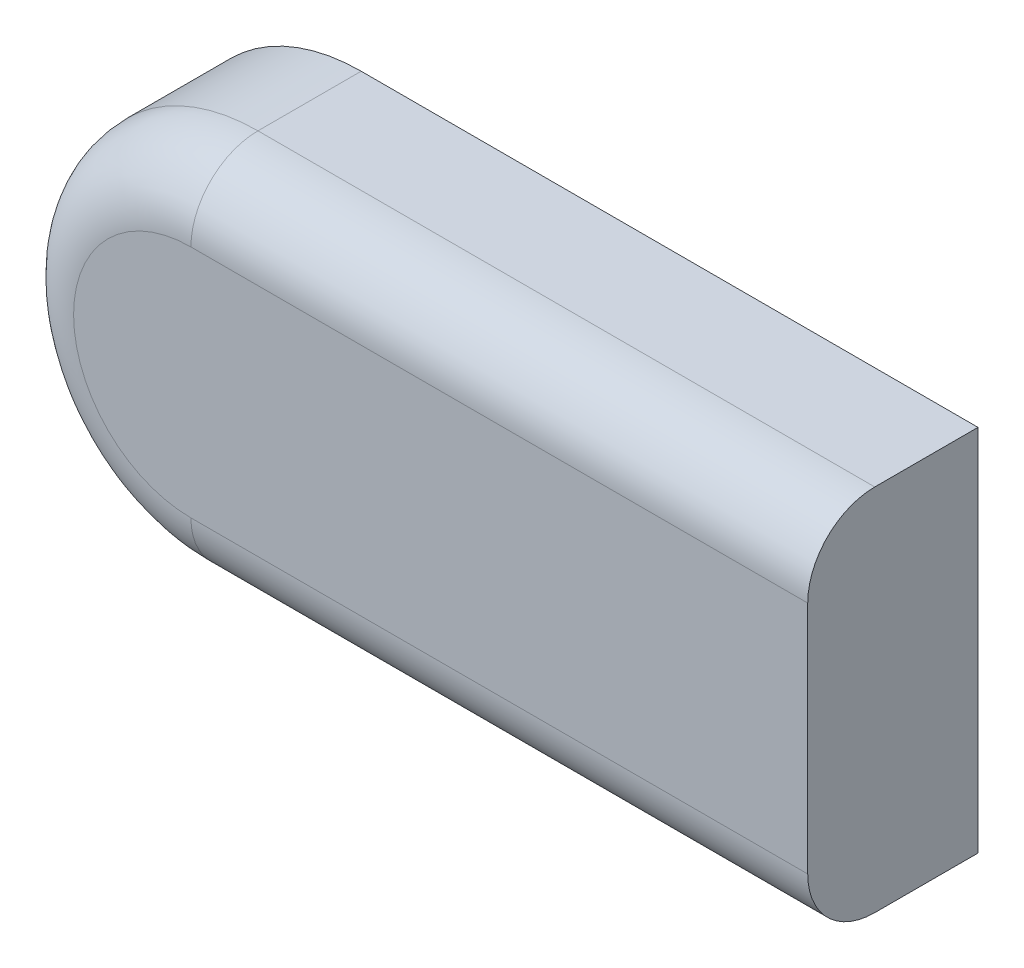
ISO-10303-21;
HEADER;
FILE_DESCRIPTION(('STEP AP214'),'2;1');
FILE_NAME('part.step','',(''),(''),'','','');
FILE_SCHEMA(('AUTOMOTIVE_DESIGN { 1 0 10303 214 1 1 1 1 }'));
ENDSEC;
DATA;
#1=APPLICATION_CONTEXT('core data for automotive mechanical design processes');
#2=APPLICATION_PROTOCOL_DEFINITION('international standard','automotive_design',2000,#1);
#3=PRODUCT_CONTEXT('',#1,'mechanical');
#4=PRODUCT('Part','Part','',(#3));
#5=PRODUCT_RELATED_PRODUCT_CATEGORY('part','',(#4));
#6=PRODUCT_DEFINITION_FORMATION('','',#4);
#7=PRODUCT_DEFINITION_CONTEXT('part definition',#1,'design');
#8=PRODUCT_DEFINITION('design','',#6,#7);
#9=PRODUCT_DEFINITION_SHAPE('','',#8);
#10=(LENGTH_UNIT() NAMED_UNIT(*) SI_UNIT(.MILLI.,.METRE.));
#11=(NAMED_UNIT(*) PLANE_ANGLE_UNIT() SI_UNIT($,.RADIAN.));
#12=(NAMED_UNIT(*) SI_UNIT($,.STERADIAN.) SOLID_ANGLE_UNIT());
#13=UNCERTAINTY_MEASURE_WITH_UNIT(LENGTH_MEASURE(1.E-05),#10,'distance_accuracy_value','');
#14=(GEOMETRIC_REPRESENTATION_CONTEXT(3) GLOBAL_UNCERTAINTY_ASSIGNED_CONTEXT((#13)) GLOBAL_UNIT_ASSIGNED_CONTEXT((#10,
#11,#12)) REPRESENTATION_CONTEXT('',''));
#15=CARTESIAN_POINT('',(0.,0.,0.));
#16=DIRECTION('',(0.,0.,1.));
#17=DIRECTION('',(1.,0.,0.));
#18=AXIS2_PLACEMENT_3D('',#15,#16,#17);
#19=CARTESIAN_POINT('',(-12.4727379340409,13.776110425869,25.4));
#20=DIRECTION('',(0.,0.,-1.));
#21=DIRECTION('',(-1.,0.,0.));
#22=AXIS2_PLACEMENT_3D('',#19,#20,#21);
#23=CYLINDRICAL_SURFACE('',#22,24.5);
#24=DIRECTION('',(0.,0.,-1.));
#25=VECTOR('',#24,1.);
#26=CARTESIAN_POINT('',(-12.4727379340409,38.276110425869,25.4));
#27=LINE('',#26,#25);
#28=CARTESIAN_POINT('',(-12.4727379340409,38.276110425869,21.4));
#29=VERTEX_POINT('',#28);
#30=CARTESIAN_POINT('',(-12.4727379340409,38.276110425869,0.));
#31=VERTEX_POINT('',#30);
#32=EDGE_CURVE('E151',#29,#31,#27,.T.);
#33=ORIENTED_EDGE('',*,*,#32,.F.);
#34=CARTESIAN_POINT('',(-12.4727379340409,13.776110425869,21.4));
#35=DIRECTION('',(0.,0.,1.));
#36=DIRECTION('',(1.,0.,0.));
#37=AXIS2_PLACEMENT_3D('',#34,#35,#36);
#38=CIRCLE('',#37,24.5);
#39=CARTESIAN_POINT('',(-12.4727379340409,-10.723889574131,21.4));
#40=VERTEX_POINT('',#39);
#41=EDGE_CURVE('E128',#29,#40,#38,.T.);
#42=ORIENTED_EDGE('',*,*,#41,.T.);
#43=DIRECTION('',(0.,0.,-1.));
#44=VECTOR('',#43,1.);
#45=CARTESIAN_POINT('',(-12.4727379340409,-10.723889574131,25.4));
#46=LINE('',#45,#44);
#47=CARTESIAN_POINT('',(-12.4727379340409,-10.723889574131,0.));
#48=VERTEX_POINT('',#47);
#49=EDGE_CURVE('E155',#40,#48,#46,.T.);
#50=ORIENTED_EDGE('',*,*,#49,.T.);
#51=CARTESIAN_POINT('',(-12.4727379340409,13.776110425869,0.));
#52=DIRECTION('',(0.,0.,1.));
#53=DIRECTION('',(1.,0.,0.));
#54=AXIS2_PLACEMENT_3D('',#51,#52,#53);
#55=CIRCLE('',#54,24.5);
#56=EDGE_CURVE('E364',#31,#48,#55,.T.);
#57=ORIENTED_EDGE('',*,*,#56,.F.);
#58=EDGE_LOOP('',(#33,#42,#50,#57));
#59=FACE_BOUND('',#58,.T.);
#60=ADVANCED_FACE('F44',(#59),#23,.F.);
#61=CARTESIAN_POINT('',(-12.4727379340409,-10.723889574131,25.4));
#62=DIRECTION('',(0.,1.,0.));
#63=DIRECTION('',(-1.,0.,0.));
#64=AXIS2_PLACEMENT_3D('',#61,#62,#63);
#65=PLANE('',#64);
#66=ORIENTED_EDGE('',*,*,#49,.F.);
#67=DIRECTION('',(1.,0.,0.));
#68=VECTOR('',#67,1.);
#69=CARTESIAN_POINT('',(-12.4727379340409,-10.723889574131,21.4));
#70=LINE('',#69,#68);
#71=CARTESIAN_POINT('',(76.1182137338325,-10.723889574131,21.4));
#72=VERTEX_POINT('',#71);
#73=EDGE_CURVE('E144',#40,#72,#70,.T.);
#74=ORIENTED_EDGE('',*,*,#73,.T.);
#75=DIRECTION('',(0.,0.,-1.));
#76=VECTOR('',#75,1.);
#77=CARTESIAN_POINT('',(76.1182137338325,-10.723889574131,25.4));
#78=LINE('',#77,#76);
#79=CARTESIAN_POINT('',(76.1182137338325,-10.723889574131,0.));
#80=VERTEX_POINT('',#79);
#81=EDGE_CURVE('E142',#72,#80,#78,.T.);
#82=ORIENTED_EDGE('',*,*,#81,.T.);
#83=DIRECTION('',(1.,0.,0.));
#84=VECTOR('',#83,1.);
#85=CARTESIAN_POINT('',(-12.4727379340409,-10.723889574131,0.));
#86=LINE('',#85,#84);
#87=EDGE_CURVE('E368',#48,#80,#86,.T.);
#88=ORIENTED_EDGE('',*,*,#87,.F.);
#89=EDGE_LOOP('',(#66,#74,#82,#88));
#90=FACE_BOUND('',#89,.T.);
#91=ADVANCED_FACE('F257',(#90),#65,.T.);
#92=CARTESIAN_POINT('',(76.1182137338325,38.276110425869,25.4));
#93=DIRECTION('',(-1.,0.,0.));
#94=DIRECTION('',(0.,0.,1.));
#95=AXIS2_PLACEMENT_3D('',#92,#93,#94);
#96=PLANE('',#95);
#97=ORIENTED_EDGE('',*,*,#81,.F.);
#98=DIRECTION('',(0.,1.,0.));
#99=VECTOR('',#98,1.);
#100=CARTESIAN_POINT('',(76.1182137338325,38.276110425869,21.4));
#101=LINE('',#100,#99);
#102=CARTESIAN_POINT('',(76.1182137338325,38.276110425869,21.4));
#103=VERTEX_POINT('',#102);
#104=EDGE_CURVE('E125',#72,#103,#101,.T.);
#105=ORIENTED_EDGE('',*,*,#104,.T.);
#106=DIRECTION('',(0.,0.,-1.));
#107=VECTOR('',#106,1.);
#108=CARTESIAN_POINT('',(76.1182137338325,38.276110425869,25.4));
#109=LINE('',#108,#107);
#110=CARTESIAN_POINT('',(76.1182137338325,38.276110425869,0.));
#111=VERTEX_POINT('',#110);
#112=EDGE_CURVE('E140',#103,#111,#109,.T.);
#113=ORIENTED_EDGE('',*,*,#112,.T.);
#114=DIRECTION('',(0.,1.,0.));
#115=VECTOR('',#114,1.);
#116=CARTESIAN_POINT('',(76.1182137338325,38.276110425869,0.));
#117=LINE('',#116,#115);
#118=EDGE_CURVE('E370',#80,#111,#117,.T.);
#119=ORIENTED_EDGE('',*,*,#118,.F.);
#120=EDGE_LOOP('',(#97,#105,#113,#119));
#121=FACE_BOUND('',#120,.T.);
#122=ADVANCED_FACE('F138',(#121),#96,.T.);
#123=CARTESIAN_POINT('',(-12.4727379340409,38.276110425869,25.4));
#124=DIRECTION('',(0.,-1.,0.));
#125=DIRECTION('',(0.,0.,-1.));
#126=AXIS2_PLACEMENT_3D('',#123,#124,#125);
#127=PLANE('',#126);
#128=ORIENTED_EDGE('',*,*,#112,.F.);
#129=DIRECTION('',(-1.,0.,0.));
#130=VECTOR('',#129,1.);
#131=CARTESIAN_POINT('',(-12.4727379340409,38.276110425869,21.4));
#132=LINE('',#131,#130);
#133=EDGE_CURVE('E122',#103,#29,#132,.T.);
#134=ORIENTED_EDGE('',*,*,#133,.T.);
#135=ORIENTED_EDGE('',*,*,#32,.T.);
#136=DIRECTION('',(-1.,0.,0.));
#137=VECTOR('',#136,1.);
#138=CARTESIAN_POINT('',(-12.4727379340409,38.276110425869,0.));
#139=LINE('',#138,#137);
#140=EDGE_CURVE('E148',#111,#31,#139,.T.);
#141=ORIENTED_EDGE('',*,*,#140,.F.);
#142=EDGE_LOOP('',(#128,#134,#135,#141));
#143=FACE_BOUND('',#142,.T.);
#144=ADVANCED_FACE('F146',(#143),#127,.T.);
#145=CARTESIAN_POINT('',(-12.8936713506942,13.776110425869,25.4));
#146=DIRECTION('',(0.,0.,1.));
#147=DIRECTION('',(1.,0.,0.));
#148=AXIS2_PLACEMENT_3D('',#145,#146,#147);
#149=PLANE('',#148);
#150=CARTESIAN_POINT('',(-12.8936713506942,13.776110425869,25.4));
#151=DIRECTION('',(0.,0.,1.));
#152=DIRECTION('',(1.,0.,0.));
#153=AXIS2_PLACEMENT_3D('',#150,#151,#152);
#154=CIRCLE('',#153,17.5);
#155=CARTESIAN_POINT('',(-12.8936713506942,31.276110425869,25.4));
#156=VERTEX_POINT('',#155);
#157=CARTESIAN_POINT('',(-12.8936713506942,-3.72388957413102,25.4));
#158=VERTEX_POINT('',#157);
#159=EDGE_CURVE('E195',#156,#158,#154,.T.);
#160=ORIENTED_EDGE('',*,*,#159,.T.);
#161=DIRECTION('',(1.,0.,0.));
#162=VECTOR('',#161,1.);
#163=CARTESIAN_POINT('',(79.1182137338325,-3.72388957413101,25.4));
#164=LINE('',#163,#162);
#165=CARTESIAN_POINT('',(79.1182137338325,-3.72388957413101,25.4));
#166=VERTEX_POINT('',#165);
#167=EDGE_CURVE('E198',#158,#166,#164,.T.);
#168=ORIENTED_EDGE('',*,*,#167,.T.);
#169=DIRECTION('',(0.,1.,0.));
#170=VECTOR('',#169,1.);
#171=CARTESIAN_POINT('',(79.1182137338325,41.276110425869,25.4));
#172=LINE('',#171,#170);
#173=CARTESIAN_POINT('',(79.1182137338325,31.276110425869,25.4));
#174=VERTEX_POINT('',#173);
#175=EDGE_CURVE('E163',#166,#174,#172,.T.);
#176=ORIENTED_EDGE('',*,*,#175,.T.);
#177=DIRECTION('',(-1.,0.,0.));
#178=VECTOR('',#177,1.);
#179=CARTESIAN_POINT('',(-12.8936713506942,31.276110425869,25.4));
#180=LINE('',#179,#178);
#181=EDGE_CURVE('E133',#174,#156,#180,.T.);
#182=ORIENTED_EDGE('',*,*,#181,.T.);
#183=EDGE_LOOP('',(#160,#168,#176,#182));
#184=FACE_BOUND('',#183,.T.);
#185=ADVANCED_FACE('F244',(#184),#149,.T.);
#186=CARTESIAN_POINT('',(-12.8936713506942,13.776110425869,0.));
#187=DIRECTION('',(0.,0.,1.));
#188=DIRECTION('',(1.,0.,0.));
#189=AXIS2_PLACEMENT_3D('',#186,#187,#188);
#190=PLANE('',#189);
#191=DIRECTION('',(0.,1.,0.));
#192=VECTOR('',#191,1.);
#193=CARTESIAN_POINT('',(79.1182137338325,41.276110425869,0.));
#194=LINE('',#193,#192);
#195=CARTESIAN_POINT('',(79.1182137338325,-13.723889574131,0.));
#196=VERTEX_POINT('',#195);
#197=CARTESIAN_POINT('',(79.1182137338325,41.276110425869,0.));
#198=VERTEX_POINT('',#197);
#199=EDGE_CURVE('E162',#196,#198,#194,.T.);
#200=ORIENTED_EDGE('',*,*,#199,.F.);
#201=DIRECTION('',(1.,0.,0.));
#202=VECTOR('',#201,1.);
#203=CARTESIAN_POINT('',(79.1182137338325,-13.723889574131,0.));
#204=LINE('',#203,#202);
#205=CARTESIAN_POINT('',(-12.8936713506942,-13.723889574131,0.));
#206=VERTEX_POINT('',#205);
#207=EDGE_CURVE('E168',#206,#196,#204,.T.);
#208=ORIENTED_EDGE('',*,*,#207,.F.);
#209=CARTESIAN_POINT('',(-12.8936713506942,13.776110425869,0.));
#210=DIRECTION('',(0.,0.,1.));
#211=DIRECTION('',(1.,0.,0.));
#212=AXIS2_PLACEMENT_3D('',#209,#210,#211);
#213=CIRCLE('',#212,27.5);
#214=CARTESIAN_POINT('',(-12.8936713506942,41.276110425869,0.));
#215=VERTEX_POINT('',#214);
#216=EDGE_CURVE('E176',#215,#206,#213,.T.);
#217=ORIENTED_EDGE('',*,*,#216,.F.);
#218=DIRECTION('',(-1.,0.,0.));
#219=VECTOR('',#218,1.);
#220=CARTESIAN_POINT('',(79.1182137338325,41.276110425869,0.));
#221=LINE('',#220,#219);
#222=EDGE_CURVE('E172',#198,#215,#221,.T.);
#223=ORIENTED_EDGE('',*,*,#222,.F.);
#224=EDGE_LOOP('',(#200,#208,#217,#223));
#225=FACE_BOUND('',#224,.T.);
#226=ORIENTED_EDGE('',*,*,#56,.T.);
#227=ORIENTED_EDGE('',*,*,#87,.T.);
#228=ORIENTED_EDGE('',*,*,#118,.T.);
#229=ORIENTED_EDGE('',*,*,#140,.T.);
#230=EDGE_LOOP('',(#226,#227,#228,#229));
#231=FACE_BOUND('',#230,.T.);
#232=ADVANCED_FACE('F237',(#225,#231),#190,.F.);
#233=CARTESIAN_POINT('',(79.1182137338325,41.276110425869,25.4));
#234=DIRECTION('',(-1.,0.,0.));
#235=DIRECTION('',(0.,0.,1.));
#236=AXIS2_PLACEMENT_3D('',#233,#234,#235);
#237=PLANE('',#236);
#238=ORIENTED_EDGE('',*,*,#175,.F.);
#239=CARTESIAN_POINT('',(79.1182137338325,-3.72388957413101,15.4));
#240=DIRECTION('',(-1.,0.,0.));
#241=DIRECTION('',(0.,0.,1.));
#242=AXIS2_PLACEMENT_3D('',#239,#240,#241);
#243=CIRCLE('',#242,10.);
#244=CARTESIAN_POINT('',(79.1182137338325,-13.723889574131,15.4));
#245=VERTEX_POINT('',#244);
#246=EDGE_CURVE('E205',#166,#245,#243,.F.);
#247=ORIENTED_EDGE('',*,*,#246,.T.);
#248=DIRECTION('',(0.,0.,-1.));
#249=VECTOR('',#248,1.);
#250=CARTESIAN_POINT('',(79.1182137338325,-13.723889574131,25.4));
#251=LINE('',#250,#249);
#252=EDGE_CURVE('E167',#245,#196,#251,.T.);
#253=ORIENTED_EDGE('',*,*,#252,.T.);
#254=ORIENTED_EDGE('',*,*,#199,.T.);
#255=DIRECTION('',(0.,0.,-1.));
#256=VECTOR('',#255,1.);
#257=CARTESIAN_POINT('',(79.1182137338325,41.276110425869,25.4));
#258=LINE('',#257,#256);
#259=CARTESIAN_POINT('',(79.1182137338325,41.276110425869,15.4));
#260=VERTEX_POINT('',#259);
#261=EDGE_CURVE('E134',#260,#198,#258,.T.);
#262=ORIENTED_EDGE('',*,*,#261,.F.);
#263=CARTESIAN_POINT('',(79.1182137338325,31.276110425869,15.4));
#264=DIRECTION('',(-1.,0.,0.));
#265=DIRECTION('',(0.,0.,1.));
#266=AXIS2_PLACEMENT_3D('',#263,#264,#265);
#267=CIRCLE('',#266,10.);
#268=EDGE_CURVE('E202',#260,#174,#267,.F.);
#269=ORIENTED_EDGE('',*,*,#268,.T.);
#270=EDGE_LOOP('',(#238,#247,#253,#254,#262,#269));
#271=FACE_BOUND('',#270,.T.);
#272=ADVANCED_FACE('F233',(#271),#237,.F.);
#273=CARTESIAN_POINT('',(79.1182137338325,41.276110425869,25.4));
#274=DIRECTION('',(0.,-1.,0.));
#275=DIRECTION('',(1.,0.,0.));
#276=AXIS2_PLACEMENT_3D('',#273,#274,#275);
#277=PLANE('',#276);
#278=DIRECTION('',(0.,0.,-1.));
#279=VECTOR('',#278,1.);
#280=CARTESIAN_POINT('',(-12.8936713506942,41.276110425869,25.4));
#281=LINE('',#280,#279);
#282=CARTESIAN_POINT('',(-12.8936713506942,41.276110425869,15.4));
#283=VERTEX_POINT('',#282);
#284=EDGE_CURVE('E188',#283,#215,#281,.T.);
#285=ORIENTED_EDGE('',*,*,#284,.F.);
#286=DIRECTION('',(-1.,0.,0.));
#287=VECTOR('',#286,1.);
#288=CARTESIAN_POINT('',(79.1182137338325,41.276110425869,15.4));
#289=LINE('',#288,#287);
#290=EDGE_CURVE('E11',#283,#260,#289,.F.);
#291=ORIENTED_EDGE('',*,*,#290,.T.);
#292=ORIENTED_EDGE('',*,*,#261,.T.);
#293=ORIENTED_EDGE('',*,*,#222,.T.);
#294=EDGE_LOOP('',(#285,#291,#292,#293));
#295=FACE_BOUND('',#294,.T.);
#296=ADVANCED_FACE('F229',(#295),#277,.F.);
#297=CARTESIAN_POINT('',(-12.8936713506942,13.776110425869,25.4));
#298=DIRECTION('',(0.,0.,-1.));
#299=DIRECTION('',(-1.,0.,0.));
#300=AXIS2_PLACEMENT_3D('',#297,#298,#299);
#301=CYLINDRICAL_SURFACE('',#300,27.5);
#302=DIRECTION('',(0.,0.,-1.));
#303=VECTOR('',#302,1.);
#304=CARTESIAN_POINT('',(-12.8936713506942,-13.723889574131,25.4));
#305=LINE('',#304,#303);
#306=CARTESIAN_POINT('',(-12.8936713506942,-13.723889574131,15.4));
#307=VERTEX_POINT('',#306);
#308=EDGE_CURVE('E185',#307,#206,#305,.T.);
#309=ORIENTED_EDGE('',*,*,#308,.F.);
#310=CARTESIAN_POINT('',(-12.8936713506942,13.776110425869,15.4));
#311=DIRECTION('',(0.,0.,1.));
#312=DIRECTION('',(1.,0.,0.));
#313=AXIS2_PLACEMENT_3D('',#310,#311,#312);
#314=CIRCLE('',#313,27.5);
#315=EDGE_CURVE('E54',#307,#283,#314,.F.);
#316=ORIENTED_EDGE('',*,*,#315,.T.);
#317=ORIENTED_EDGE('',*,*,#284,.T.);
#318=ORIENTED_EDGE('',*,*,#216,.T.);
#319=EDGE_LOOP('',(#309,#316,#317,#318));
#320=FACE_BOUND('',#319,.T.);
#321=ADVANCED_FACE('F240',(#320),#301,.T.);
#322=CARTESIAN_POINT('',(79.1182137338325,-13.723889574131,25.4));
#323=DIRECTION('',(0.,1.,0.));
#324=DIRECTION('',(-1.,0.,0.));
#325=AXIS2_PLACEMENT_3D('',#322,#323,#324);
#326=PLANE('',#325);
#327=ORIENTED_EDGE('',*,*,#252,.F.);
#328=DIRECTION('',(1.,0.,0.));
#329=VECTOR('',#328,1.);
#330=CARTESIAN_POINT('',(-12.8936713506942,-13.723889574131,15.4));
#331=LINE('',#330,#329);
#332=EDGE_CURVE('E69',#245,#307,#331,.F.);
#333=ORIENTED_EDGE('',*,*,#332,.T.);
#334=ORIENTED_EDGE('',*,*,#308,.T.);
#335=ORIENTED_EDGE('',*,*,#207,.T.);
#336=EDGE_LOOP('',(#327,#333,#334,#335));
#337=FACE_BOUND('',#336,.T.);
#338=ADVANCED_FACE('F241',(#337),#326,.F.);
#339=CARTESIAN_POINT('',(-12.8936713506943,13.776110425869,21.4));
#340=DIRECTION('',(0.,0.,1.));
#341=DIRECTION('',(1.,0.,0.));
#342=AXIS2_PLACEMENT_3D('',#339,#340,#341);
#343=PLANE('',#342);
#344=ORIENTED_EDGE('',*,*,#41,.F.);
#345=ORIENTED_EDGE('',*,*,#133,.F.);
#346=ORIENTED_EDGE('',*,*,#104,.F.);
#347=ORIENTED_EDGE('',*,*,#73,.F.);
#348=EDGE_LOOP('',(#344,#345,#346,#347));
#349=FACE_BOUND('',#348,.T.);
#350=ADVANCED_FACE('F124',(#349),#343,.F.);
#351=CARTESIAN_POINT('',(-12.8936713506942,31.276110425869,15.4));
#352=DIRECTION('',(1.,0.,0.));
#353=DIRECTION('',(0.,1.,0.));
#354=AXIS2_PLACEMENT_3D('',#351,#352,#353);
#355=CYLINDRICAL_SURFACE('',#354,10.);
#356=ORIENTED_EDGE('',*,*,#268,.F.);
#357=ORIENTED_EDGE('',*,*,#290,.F.);
#358=CARTESIAN_POINT('',(-12.8936713506942,31.276110425869,15.4));
#359=DIRECTION('',(-1.,0.,0.));
#360=DIRECTION('',(0.,-1.,0.));
#361=AXIS2_PLACEMENT_3D('',#358,#359,#360);
#362=CIRCLE('',#361,10.);
#363=EDGE_CURVE('E48',#156,#283,#362,.T.);
#364=ORIENTED_EDGE('',*,*,#363,.F.);
#365=ORIENTED_EDGE('',*,*,#181,.F.);
#366=EDGE_LOOP('',(#356,#357,#364,#365));
#367=FACE_BOUND('',#366,.T.);
#368=ADVANCED_FACE('F46',(#367),#355,.T.);
#369=CARTESIAN_POINT('',(-12.8936713506942,13.776110425869,15.4));
#370=DIRECTION('',(0.,0.,1.));
#371=DIRECTION('',(1.,0.,0.));
#372=AXIS2_PLACEMENT_3D('',#369,#370,#371);
#373=TOROIDAL_SURFACE('',#372,17.5,10.);
#374=ORIENTED_EDGE('',*,*,#363,.T.);
#375=ORIENTED_EDGE('',*,*,#315,.F.);
#376=CARTESIAN_POINT('',(-12.8936713506942,-3.72388957413102,15.4));
#377=DIRECTION('',(1.,0.,0.));
#378=DIRECTION('',(0.,1.,0.));
#379=AXIS2_PLACEMENT_3D('',#376,#377,#378);
#380=CIRCLE('',#379,10.);
#381=EDGE_CURVE('E211',#158,#307,#380,.T.);
#382=ORIENTED_EDGE('',*,*,#381,.F.);
#383=ORIENTED_EDGE('',*,*,#159,.F.);
#384=EDGE_LOOP('',(#374,#375,#382,#383));
#385=FACE_BOUND('',#384,.T.);
#386=ADVANCED_FACE('F222',(#385),#373,.T.);
#387=CARTESIAN_POINT('',(-12.8936713506942,-3.72388957413103,15.4));
#388=DIRECTION('',(-1.,0.,0.));
#389=DIRECTION('',(0.,-1.,0.));
#390=AXIS2_PLACEMENT_3D('',#387,#388,#389);
#391=CYLINDRICAL_SURFACE('',#390,10.);
#392=ORIENTED_EDGE('',*,*,#381,.T.);
#393=ORIENTED_EDGE('',*,*,#332,.F.);
#394=ORIENTED_EDGE('',*,*,#246,.F.);
#395=ORIENTED_EDGE('',*,*,#167,.F.);
#396=EDGE_LOOP('',(#392,#393,#394,#395));
#397=FACE_BOUND('',#396,.T.);
#398=ADVANCED_FACE('F242',(#397),#391,.T.);
#399=CLOSED_SHELL('',(#60,#91,#122,#144,#185,#232,#272,#296,#321,#338,#350,#368,#386,#398));
#400=MANIFOLD_SOLID_BREP('B2',#399);
#401=ADVANCED_BREP_SHAPE_REPRESENTATION('',(#18,#400),#14);
#402=SHAPE_DEFINITION_REPRESENTATION(#9,#401);
ENDSEC;
END-ISO-10303-21;
